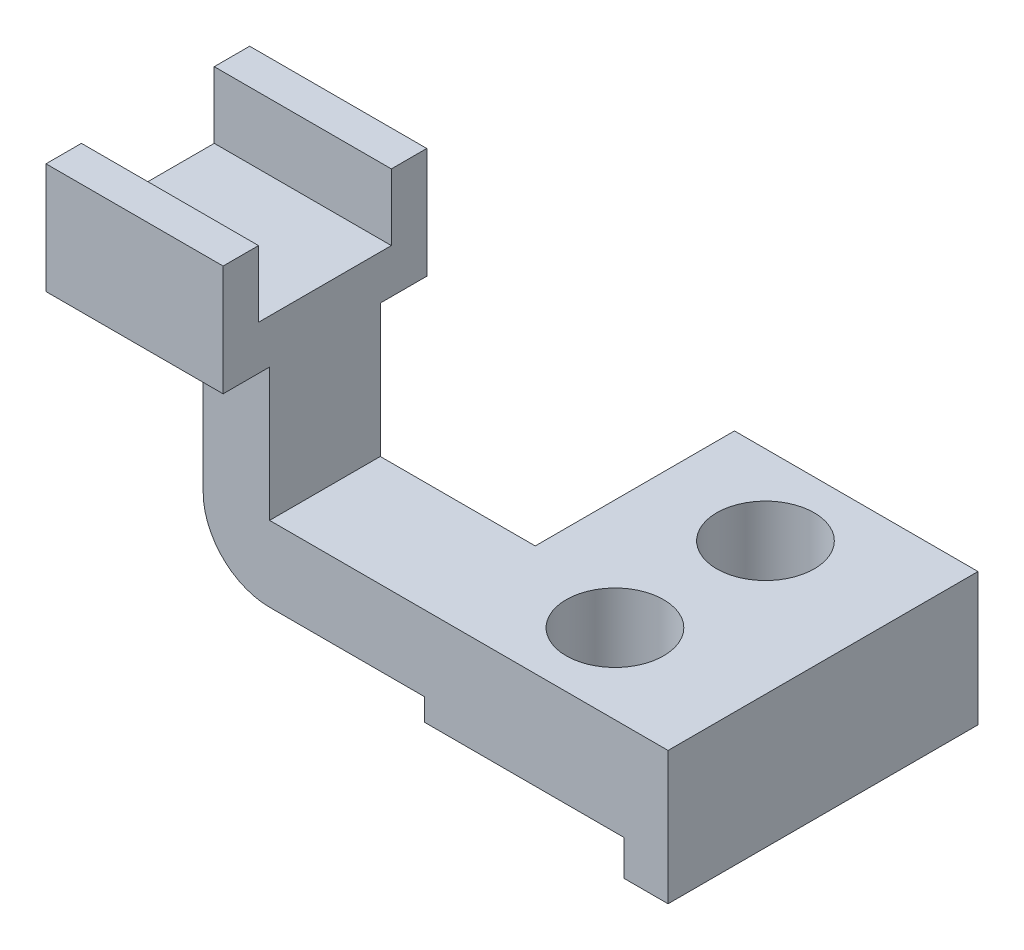
ISO-10303-21;
HEADER;
FILE_DESCRIPTION(('STEP AP214'),'2;1');
FILE_NAME('part.step','',(''),(''),'','','');
FILE_SCHEMA(('AUTOMOTIVE_DESIGN { 1 0 10303 214 1 1 1 1 }'));
ENDSEC;
DATA;
#1=APPLICATION_CONTEXT('core data for automotive mechanical design processes');
#2=APPLICATION_PROTOCOL_DEFINITION('international standard','automotive_design',2000,#1);
#3=PRODUCT_CONTEXT('',#1,'mechanical');
#4=PRODUCT('Part','Part','',(#3));
#5=PRODUCT_RELATED_PRODUCT_CATEGORY('part','',(#4));
#6=PRODUCT_DEFINITION_FORMATION('','',#4);
#7=PRODUCT_DEFINITION_CONTEXT('part definition',#1,'design');
#8=PRODUCT_DEFINITION('design','',#6,#7);
#9=PRODUCT_DEFINITION_SHAPE('','',#8);
#10=(LENGTH_UNIT() NAMED_UNIT(*) SI_UNIT(.MILLI.,.METRE.));
#11=(NAMED_UNIT(*) PLANE_ANGLE_UNIT() SI_UNIT($,.RADIAN.));
#12=(NAMED_UNIT(*) SI_UNIT($,.STERADIAN.) SOLID_ANGLE_UNIT());
#13=UNCERTAINTY_MEASURE_WITH_UNIT(LENGTH_MEASURE(1.E-05),#10,'distance_accuracy_value','');
#14=(GEOMETRIC_REPRESENTATION_CONTEXT(3) GLOBAL_UNCERTAINTY_ASSIGNED_CONTEXT((#13)) GLOBAL_UNIT_ASSIGNED_CONTEXT((#10,
#11,#12)) REPRESENTATION_CONTEXT('',''));
#15=CARTESIAN_POINT('',(0.,0.,0.));
#16=DIRECTION('',(0.,0.,1.));
#17=DIRECTION('',(1.,0.,0.));
#18=AXIS2_PLACEMENT_3D('',#15,#16,#17);
#19=CARTESIAN_POINT('',(0.,30.,0.));
#20=DIRECTION('',(0.,-1.,0.));
#21=DIRECTION('',(0.,0.,-1.));
#22=AXIS2_PLACEMENT_3D('',#19,#20,#21);
#23=PLANE('',#22);
#24=DIRECTION('',(-1.,0.,0.));
#25=VECTOR('',#24,1.);
#26=CARTESIAN_POINT('',(-63.9822183831885,30.,-1.29574439418017));
#27=LINE('',#26,#25);
#28=CARTESIAN_POINT('',(-28.9822183831885,30.,-1.29574439418017));
#29=VERTEX_POINT('',#28);
#30=CARTESIAN_POINT('',(-63.9822183831885,30.,-1.29574439418017));
#31=VERTEX_POINT('',#30);
#32=EDGE_CURVE('E260',#29,#31,#27,.T.);
#33=ORIENTED_EDGE('',*,*,#32,.T.);
#34=DIRECTION('',(0.,0.,1.));
#35=VECTOR('',#34,1.);
#36=CARTESIAN_POINT('',(-63.9822183831885,30.,-1.29574439418017));
#37=LINE('',#36,#35);
#38=CARTESIAN_POINT('',(-63.9822183831885,30.,23.7042556058198));
#39=VERTEX_POINT('',#38);
#40=EDGE_CURVE('E263',#31,#39,#37,.T.);
#41=ORIENTED_EDGE('',*,*,#40,.T.);
#42=DIRECTION('',(1.,0.,0.));
#43=VECTOR('',#42,1.);
#44=CARTESIAN_POINT('',(-63.9822183831885,30.,23.7042556058198));
#45=LINE('',#44,#43);
#46=CARTESIAN_POINT('',(26.0177816168115,30.,23.7042556058198));
#47=VERTEX_POINT('',#46);
#48=EDGE_CURVE('E267',#39,#47,#45,.T.);
#49=ORIENTED_EDGE('',*,*,#48,.T.);
#50=DIRECTION('',(0.,0.,-1.));
#51=VECTOR('',#50,1.);
#52=CARTESIAN_POINT('',(26.0177816168115,30.,-46.2957443941802));
#53=LINE('',#52,#51);
#54=CARTESIAN_POINT('',(26.0177816168115,30.,-46.2957443941802));
#55=VERTEX_POINT('',#54);
#56=EDGE_CURVE('E269',#47,#55,#53,.T.);
#57=ORIENTED_EDGE('',*,*,#56,.T.);
#58=DIRECTION('',(-1.,0.,0.));
#59=VECTOR('',#58,1.);
#60=CARTESIAN_POINT('',(26.0177816168115,30.,-46.2957443941802));
#61=LINE('',#60,#59);
#62=CARTESIAN_POINT('',(-28.9822183831885,30.,-46.2957443941802));
#63=VERTEX_POINT('',#62);
#64=EDGE_CURVE('E271',#55,#63,#61,.T.);
#65=ORIENTED_EDGE('',*,*,#64,.T.);
#66=DIRECTION('',(0.,0.,1.));
#67=VECTOR('',#66,1.);
#68=CARTESIAN_POINT('',(-28.9822183831885,30.,-46.2957443941802));
#69=LINE('',#68,#67);
#70=EDGE_CURVE('E273',#63,#29,#69,.T.);
#71=ORIENTED_EDGE('',*,*,#70,.T.);
#72=EDGE_LOOP('',(#33,#41,#49,#57,#65,#71));
#73=FACE_BOUND('',#72,.T.);
#74=CARTESIAN_POINT('',(-3.98221838318849,30.,5.70425560581984));
#75=DIRECTION('',(0.,1.,0.));
#76=DIRECTION('',(0.,0.,1.));
#77=AXIS2_PLACEMENT_3D('',#74,#75,#76);
#78=CIRCLE('',#77,11.);
#79=CARTESIAN_POINT('',(-3.98221838318849,30.,16.7042556058198));
#80=VERTEX_POINT('',#79);
#81=EDGE_CURVE('E256',#80,#80,#78,.T.);
#82=ORIENTED_EDGE('',*,*,#81,.F.);
#83=EDGE_LOOP('',(#82));
#84=FACE_BOUND('',#83,.T.);
#85=CARTESIAN_POINT('',(-3.98221838318849,30.,-28.2957443941802));
#86=DIRECTION('',(0.,1.,0.));
#87=DIRECTION('',(0.,0.,1.));
#88=AXIS2_PLACEMENT_3D('',#85,#86,#87);
#89=CIRCLE('',#88,11.);
#90=CARTESIAN_POINT('',(-3.98221838318849,30.,-17.2957443941802));
#91=VERTEX_POINT('',#90);
#92=EDGE_CURVE('E253',#91,#91,#89,.T.);
#93=ORIENTED_EDGE('',*,*,#92,.F.);
#94=EDGE_LOOP('',(#93));
#95=FACE_BOUND('',#94,.T.);
#96=ADVANCED_FACE('F38',(#73,#84,#95),#23,.F.);
#97=CARTESIAN_POINT('',(0.,0.,0.));
#98=DIRECTION('',(0.,-1.,0.));
#99=DIRECTION('',(0.,0.,-1.));
#100=AXIS2_PLACEMENT_3D('',#97,#98,#99);
#101=PLANE('',#100);
#102=DIRECTION('',(0.,0.,1.));
#103=VECTOR('',#102,1.);
#104=CARTESIAN_POINT('',(16.0177816168115,0.,-46.2957443941802));
#105=LINE('',#104,#103);
#106=CARTESIAN_POINT('',(16.0177816168115,0.,-46.2957443941802));
#107=VERTEX_POINT('',#106);
#108=CARTESIAN_POINT('',(16.0177816168115,0.,23.7042556058198));
#109=VERTEX_POINT('',#108);
#110=EDGE_CURVE('E246',#107,#109,#105,.T.);
#111=ORIENTED_EDGE('',*,*,#110,.F.);
#112=DIRECTION('',(-1.,0.,0.));
#113=VECTOR('',#112,1.);
#114=CARTESIAN_POINT('',(26.0177816168115,0.,-46.2957443941802));
#115=LINE('',#114,#113);
#116=CARTESIAN_POINT('',(26.0177816168115,0.,-46.2957443941802));
#117=VERTEX_POINT('',#116);
#118=EDGE_CURVE('E264',#117,#107,#115,.T.);
#119=ORIENTED_EDGE('',*,*,#118,.F.);
#120=DIRECTION('',(0.,0.,-1.));
#121=VECTOR('',#120,1.);
#122=CARTESIAN_POINT('',(26.0177816168115,0.,-46.2957443941802));
#123=LINE('',#122,#121);
#124=CARTESIAN_POINT('',(26.0177816168115,0.,23.7042556058198));
#125=VERTEX_POINT('',#124);
#126=EDGE_CURVE('E277',#125,#117,#123,.T.);
#127=ORIENTED_EDGE('',*,*,#126,.F.);
#128=DIRECTION('',(1.,0.,0.));
#129=VECTOR('',#128,1.);
#130=CARTESIAN_POINT('',(-63.9822183831885,0.,23.7042556058198));
#131=LINE('',#130,#129);
#132=EDGE_CURVE('E259',#109,#125,#131,.T.);
#133=ORIENTED_EDGE('',*,*,#132,.F.);
#134=EDGE_LOOP('',(#111,#119,#127,#133));
#135=FACE_BOUND('',#134,.T.);
#136=ADVANCED_FACE('F441',(#135),#101,.T.);
#137=CARTESIAN_POINT('',(-63.9822183831885,30.,-1.29574439418017));
#138=DIRECTION('',(0.,0.,1.));
#139=DIRECTION('',(1.,0.,0.));
#140=AXIS2_PLACEMENT_3D('',#137,#138,#139);
#141=PLANE('',#140);
#142=DIRECTION('',(-1.,0.,0.));
#143=VECTOR('',#142,1.);
#144=CARTESIAN_POINT('',(-63.9822183831885,13.,-1.29574439418017));
#145=LINE('',#144,#143);
#146=CARTESIAN_POINT('',(-28.9822183831885,13.,-1.29574439418017));
#147=VERTEX_POINT('',#146);
#148=CARTESIAN_POINT('',(-63.9822183831885,13.,-1.29574439418017));
#149=VERTEX_POINT('',#148);
#150=EDGE_CURVE('E252',#147,#149,#145,.T.);
#151=ORIENTED_EDGE('',*,*,#150,.T.);
#152=CARTESIAN_POINT('',(-63.9822183831885,28.,-1.29574439418017));
#153=DIRECTION('',(0.,0.,1.));
#154=DIRECTION('',(1.,0.,0.));
#155=AXIS2_PLACEMENT_3D('',#152,#153,#154);
#156=CIRCLE('',#155,15.);
#157=CARTESIAN_POINT('',(-78.9822183831885,28.,-1.29574439418017));
#158=VERTEX_POINT('',#157);
#159=EDGE_CURVE('E12',#149,#158,#156,.F.);
#160=ORIENTED_EDGE('',*,*,#159,.T.);
#161=DIRECTION('',(0.,1.,0.));
#162=VECTOR('',#161,1.);
#163=CARTESIAN_POINT('',(-78.9822183831885,30.,-1.29574439418017));
#164=LINE('',#163,#162);
#165=CARTESIAN_POINT('',(-78.9822183831885,60.,-1.29574439418017));
#166=VERTEX_POINT('',#165);
#167=EDGE_CURVE('E174',#158,#166,#164,.T.);
#168=ORIENTED_EDGE('',*,*,#167,.T.);
#169=DIRECTION('',(-1.,0.,0.));
#170=VECTOR('',#169,1.);
#171=CARTESIAN_POINT('',(-63.9822183831885,60.,-1.29574439418017));
#172=LINE('',#171,#170);
#173=CARTESIAN_POINT('',(-63.9822183831885,60.,-1.29574439418017));
#174=VERTEX_POINT('',#173);
#175=EDGE_CURVE('E179',#174,#166,#172,.T.);
#176=ORIENTED_EDGE('',*,*,#175,.F.);
#177=DIRECTION('',(0.,-1.,0.));
#178=VECTOR('',#177,1.);
#179=CARTESIAN_POINT('',(-63.9822183831885,60.,-1.29574439418017));
#180=LINE('',#179,#178);
#181=EDGE_CURVE('E209',#174,#31,#180,.T.);
#182=ORIENTED_EDGE('',*,*,#181,.T.);
#183=ORIENTED_EDGE('',*,*,#32,.F.);
#184=DIRECTION('',(0.,-1.,0.));
#185=VECTOR('',#184,1.);
#186=CARTESIAN_POINT('',(-28.9822183831885,30.,-1.29574439418017));
#187=LINE('',#186,#185);
#188=EDGE_CURVE('E275',#29,#147,#187,.T.);
#189=ORIENTED_EDGE('',*,*,#188,.T.);
#190=EDGE_LOOP('',(#151,#160,#168,#176,#182,#183,#189));
#191=FACE_BOUND('',#190,.T.);
#192=ADVANCED_FACE('F176',(#191),#141,.F.);
#193=CARTESIAN_POINT('',(-63.9822183831885,30.,23.7042556058198));
#194=DIRECTION('',(0.,0.,-1.));
#195=DIRECTION('',(-1.,0.,0.));
#196=AXIS2_PLACEMENT_3D('',#193,#194,#195);
#197=PLANE('',#196);
#198=DIRECTION('',(0.,1.,0.));
#199=VECTOR('',#198,1.);
#200=CARTESIAN_POINT('',(-78.9822183831885,13.,23.7042556058198));
#201=LINE('',#200,#199);
#202=CARTESIAN_POINT('',(-78.9822183831885,28.,23.7042556058198));
#203=VERTEX_POINT('',#202);
#204=CARTESIAN_POINT('',(-78.9822183831885,60.,23.7042556058198));
#205=VERTEX_POINT('',#204);
#206=EDGE_CURVE('E190',#203,#205,#201,.T.);
#207=ORIENTED_EDGE('',*,*,#206,.F.);
#208=CARTESIAN_POINT('',(-63.9822183831885,28.,23.7042556058198));
#209=DIRECTION('',(0.,0.,-1.));
#210=DIRECTION('',(-1.,0.,0.));
#211=AXIS2_PLACEMENT_3D('',#208,#209,#210);
#212=CIRCLE('',#211,15.);
#213=CARTESIAN_POINT('',(-63.9822183831885,13.,23.7042556058198));
#214=VERTEX_POINT('',#213);
#215=EDGE_CURVE('E60',#203,#214,#212,.F.);
#216=ORIENTED_EDGE('',*,*,#215,.T.);
#217=DIRECTION('',(-1.,0.,0.));
#218=VECTOR('',#217,1.);
#219=CARTESIAN_POINT('',(0.,13.,23.7042556058198));
#220=LINE('',#219,#218);
#221=CARTESIAN_POINT('',(-28.9822183831885,13.,23.7042556058198));
#222=VERTEX_POINT('',#221);
#223=EDGE_CURVE('E235',#222,#214,#220,.T.);
#224=ORIENTED_EDGE('',*,*,#223,.F.);
#225=DIRECTION('',(0.,1.,0.));
#226=VECTOR('',#225,1.);
#227=CARTESIAN_POINT('',(-28.9822183831885,0.,23.7042556058198));
#228=LINE('',#227,#226);
#229=CARTESIAN_POINT('',(-28.9822183831885,7.99999999999999,23.7042556058198));
#230=VERTEX_POINT('',#229);
#231=EDGE_CURVE('E211',#230,#222,#228,.T.);
#232=ORIENTED_EDGE('',*,*,#231,.F.);
#233=DIRECTION('',(-1.,0.,0.));
#234=VECTOR('',#233,1.);
#235=CARTESIAN_POINT('',(0.,8.,23.7042556058198));
#236=LINE('',#235,#234);
#237=CARTESIAN_POINT('',(16.0177816168115,8.,23.7042556058198));
#238=VERTEX_POINT('',#237);
#239=EDGE_CURVE('E229',#238,#230,#236,.T.);
#240=ORIENTED_EDGE('',*,*,#239,.F.);
#241=DIRECTION('',(0.,1.,0.));
#242=VECTOR('',#241,1.);
#243=CARTESIAN_POINT('',(16.0177816168115,0.,23.7042556058198));
#244=LINE('',#243,#242);
#245=EDGE_CURVE('E236',#109,#238,#244,.T.);
#246=ORIENTED_EDGE('',*,*,#245,.F.);
#247=ORIENTED_EDGE('',*,*,#132,.T.);
#248=DIRECTION('',(0.,-1.,0.));
#249=VECTOR('',#248,1.);
#250=CARTESIAN_POINT('',(26.0177816168115,30.,23.7042556058198));
#251=LINE('',#250,#249);
#252=EDGE_CURVE('E288',#47,#125,#251,.T.);
#253=ORIENTED_EDGE('',*,*,#252,.F.);
#254=ORIENTED_EDGE('',*,*,#48,.F.);
#255=DIRECTION('',(0.,1.,0.));
#256=VECTOR('',#255,1.);
#257=CARTESIAN_POINT('',(-63.9822183831885,13.,23.7042556058198));
#258=LINE('',#257,#256);
#259=CARTESIAN_POINT('',(-63.9822183831885,60.,23.7042556058198));
#260=VERTEX_POINT('',#259);
#261=EDGE_CURVE('E212',#39,#260,#258,.T.);
#262=ORIENTED_EDGE('',*,*,#261,.T.);
#263=DIRECTION('',(-1.,0.,0.));
#264=VECTOR('',#263,1.);
#265=CARTESIAN_POINT('',(-63.9822183831885,60.,23.7042556058198));
#266=LINE('',#265,#264);
#267=EDGE_CURVE('E217',#260,#205,#266,.T.);
#268=ORIENTED_EDGE('',*,*,#267,.T.);
#269=EDGE_LOOP('',(#207,#216,#224,#232,#240,#246,#247,#253,#254,#262,#268));
#270=FACE_BOUND('',#269,.T.);
#271=ADVANCED_FACE('F302',(#270),#197,.F.);
#272=CARTESIAN_POINT('',(26.0177816168115,30.,-46.2957443941802));
#273=DIRECTION('',(-1.,0.,0.));
#274=DIRECTION('',(0.,0.,1.));
#275=AXIS2_PLACEMENT_3D('',#272,#273,#274);
#276=PLANE('',#275);
#277=ORIENTED_EDGE('',*,*,#126,.T.);
#278=DIRECTION('',(0.,-1.,0.));
#279=VECTOR('',#278,1.);
#280=CARTESIAN_POINT('',(26.0177816168115,30.,-46.2957443941802));
#281=LINE('',#280,#279);
#282=EDGE_CURVE('E285',#55,#117,#281,.T.);
#283=ORIENTED_EDGE('',*,*,#282,.F.);
#284=ORIENTED_EDGE('',*,*,#56,.F.);
#285=ORIENTED_EDGE('',*,*,#252,.T.);
#286=EDGE_LOOP('',(#277,#283,#284,#285));
#287=FACE_BOUND('',#286,.T.);
#288=ADVANCED_FACE('F457',(#287),#276,.F.);
#289=CARTESIAN_POINT('',(26.0177816168115,30.,-46.2957443941802));
#290=DIRECTION('',(0.,0.,1.));
#291=DIRECTION('',(1.,0.,0.));
#292=AXIS2_PLACEMENT_3D('',#289,#290,#291);
#293=PLANE('',#292);
#294=DIRECTION('',(0.,1.,0.));
#295=VECTOR('',#294,1.);
#296=CARTESIAN_POINT('',(16.0177816168115,0.,-46.2957443941802));
#297=LINE('',#296,#295);
#298=CARTESIAN_POINT('',(16.0177816168115,8.,-46.2957443941802));
#299=VERTEX_POINT('',#298);
#300=EDGE_CURVE('E225',#107,#299,#297,.T.);
#301=ORIENTED_EDGE('',*,*,#300,.T.);
#302=DIRECTION('',(-1.,0.,0.));
#303=VECTOR('',#302,1.);
#304=CARTESIAN_POINT('',(0.,8.,-46.2957443941802));
#305=LINE('',#304,#303);
#306=CARTESIAN_POINT('',(-28.9822183831885,7.99999999999999,-46.2957443941802));
#307=VERTEX_POINT('',#306);
#308=EDGE_CURVE('E228',#299,#307,#305,.T.);
#309=ORIENTED_EDGE('',*,*,#308,.T.);
#310=DIRECTION('',(0.,-1.,0.));
#311=VECTOR('',#310,1.);
#312=CARTESIAN_POINT('',(-28.9822183831885,30.,-46.2957443941802));
#313=LINE('',#312,#311);
#314=EDGE_CURVE('E283',#63,#307,#313,.T.);
#315=ORIENTED_EDGE('',*,*,#314,.F.);
#316=ORIENTED_EDGE('',*,*,#64,.F.);
#317=ORIENTED_EDGE('',*,*,#282,.T.);
#318=ORIENTED_EDGE('',*,*,#118,.T.);
#319=EDGE_LOOP('',(#301,#309,#315,#316,#317,#318));
#320=FACE_BOUND('',#319,.T.);
#321=ADVANCED_FACE('F454',(#320),#293,.F.);
#322=CARTESIAN_POINT('',(-28.9822183831885,30.,-46.2957443941802));
#323=DIRECTION('',(1.,0.,0.));
#324=DIRECTION('',(0.,0.,-1.));
#325=AXIS2_PLACEMENT_3D('',#322,#323,#324);
#326=PLANE('',#325);
#327=ORIENTED_EDGE('',*,*,#314,.T.);
#328=DIRECTION('',(0.,0.,1.));
#329=VECTOR('',#328,1.);
#330=CARTESIAN_POINT('',(-28.9822183831885,7.99999999999999,-46.2957443941802));
#331=LINE('',#330,#329);
#332=EDGE_CURVE('E241',#307,#230,#331,.T.);
#333=ORIENTED_EDGE('',*,*,#332,.T.);
#334=ORIENTED_EDGE('',*,*,#231,.T.);
#335=DIRECTION('',(0.,0.,1.));
#336=VECTOR('',#335,1.);
#337=CARTESIAN_POINT('',(-28.9822183831885,13.,-46.2957443941802));
#338=LINE('',#337,#336);
#339=EDGE_CURVE('E232',#147,#222,#338,.T.);
#340=ORIENTED_EDGE('',*,*,#339,.F.);
#341=ORIENTED_EDGE('',*,*,#188,.F.);
#342=ORIENTED_EDGE('',*,*,#70,.F.);
#343=EDGE_LOOP('',(#327,#333,#334,#340,#341,#342));
#344=FACE_BOUND('',#343,.T.);
#345=ADVANCED_FACE('F433',(#344),#326,.F.);
#346=CARTESIAN_POINT('',(-3.98221838318849,30.,5.70425560581984));
#347=DIRECTION('',(0.,-1.,0.));
#348=DIRECTION('',(0.,0.,-1.));
#349=AXIS2_PLACEMENT_3D('',#346,#347,#348);
#350=CYLINDRICAL_SURFACE('',#349,11.);
#351=CARTESIAN_POINT('',(-3.98221838318849,8.,5.70425560581984));
#352=DIRECTION('',(0.,1.,0.));
#353=DIRECTION('',(-1.,0.,0.));
#354=AXIS2_PLACEMENT_3D('',#351,#352,#353);
#355=CIRCLE('',#354,11.);
#356=CARTESIAN_POINT('',(-14.9822183831885,8.,5.70425560581984));
#357=VERTEX_POINT('',#356);
#358=EDGE_CURVE('E249',#357,#357,#355,.T.);
#359=ORIENTED_EDGE('',*,*,#358,.F.);
#360=EDGE_LOOP('',(#359));
#361=FACE_BOUND('',#360,.T.);
#362=ORIENTED_EDGE('',*,*,#81,.T.);
#363=EDGE_LOOP('',(#362));
#364=FACE_BOUND('',#363,.T.);
#365=ADVANCED_FACE('F449',(#361,#364),#350,.F.);
#366=CARTESIAN_POINT('',(-3.98221838318849,30.,-28.2957443941802));
#367=DIRECTION('',(0.,-1.,0.));
#368=DIRECTION('',(0.,0.,-1.));
#369=AXIS2_PLACEMENT_3D('',#366,#367,#368);
#370=CYLINDRICAL_SURFACE('',#369,11.);
#371=CARTESIAN_POINT('',(-3.98221838318849,8.,-28.2957443941802));
#372=DIRECTION('',(0.,1.,0.));
#373=DIRECTION('',(-1.,0.,0.));
#374=AXIS2_PLACEMENT_3D('',#371,#372,#373);
#375=CIRCLE('',#374,11.);
#376=CARTESIAN_POINT('',(-14.9822183831885,8.,-28.2957443941802));
#377=VERTEX_POINT('',#376);
#378=EDGE_CURVE('E243',#377,#377,#375,.T.);
#379=ORIENTED_EDGE('',*,*,#378,.F.);
#380=EDGE_LOOP('',(#379));
#381=FACE_BOUND('',#380,.T.);
#382=ORIENTED_EDGE('',*,*,#92,.T.);
#383=EDGE_LOOP('',(#382));
#384=FACE_BOUND('',#383,.T.);
#385=ADVANCED_FACE('F492',(#381,#384),#370,.F.);
#386=CARTESIAN_POINT('',(0.,13.,-46.2957443941802));
#387=DIRECTION('',(0.,1.,0.));
#388=DIRECTION('',(0.,0.,1.));
#389=AXIS2_PLACEMENT_3D('',#386,#387,#388);
#390=PLANE('',#389);
#391=ORIENTED_EDGE('',*,*,#223,.T.);
#392=DIRECTION('',(0.,0.,1.));
#393=VECTOR('',#392,1.);
#394=CARTESIAN_POINT('',(-63.9822183831885,13.,-46.2957443941802));
#395=LINE('',#394,#393);
#396=EDGE_CURVE('E46',#214,#149,#395,.F.);
#397=ORIENTED_EDGE('',*,*,#396,.T.);
#398=ORIENTED_EDGE('',*,*,#150,.F.);
#399=ORIENTED_EDGE('',*,*,#339,.T.);
#400=EDGE_LOOP('',(#391,#397,#398,#399));
#401=FACE_BOUND('',#400,.T.);
#402=ADVANCED_FACE('F499',(#401),#390,.F.);
#403=CARTESIAN_POINT('',(0.,8.,-46.2957443941802));
#404=DIRECTION('',(0.,1.,0.));
#405=DIRECTION('',(-1.,0.,0.));
#406=AXIS2_PLACEMENT_3D('',#403,#404,#405);
#407=PLANE('',#406);
#408=ORIENTED_EDGE('',*,*,#358,.T.);
#409=EDGE_LOOP('',(#408));
#410=FACE_BOUND('',#409,.T.);
#411=ORIENTED_EDGE('',*,*,#378,.T.);
#412=EDGE_LOOP('',(#411));
#413=FACE_BOUND('',#412,.T.);
#414=ORIENTED_EDGE('',*,*,#239,.T.);
#415=ORIENTED_EDGE('',*,*,#332,.F.);
#416=ORIENTED_EDGE('',*,*,#308,.F.);
#417=DIRECTION('',(0.,0.,1.));
#418=VECTOR('',#417,1.);
#419=CARTESIAN_POINT('',(16.0177816168115,8.,-46.2957443941802));
#420=LINE('',#419,#418);
#421=EDGE_CURVE('E244',#299,#238,#420,.T.);
#422=ORIENTED_EDGE('',*,*,#421,.T.);
#423=EDGE_LOOP('',(#414,#415,#416,#422));
#424=FACE_BOUND('',#423,.T.);
#425=ADVANCED_FACE('F506',(#410,#413,#424),#407,.F.);
#426=CARTESIAN_POINT('',(16.0177816168115,0.,-46.2957443941802));
#427=DIRECTION('',(1.,0.,0.));
#428=DIRECTION('',(0.,0.,-1.));
#429=AXIS2_PLACEMENT_3D('',#426,#427,#428);
#430=PLANE('',#429);
#431=ORIENTED_EDGE('',*,*,#245,.T.);
#432=ORIENTED_EDGE('',*,*,#421,.F.);
#433=ORIENTED_EDGE('',*,*,#300,.F.);
#434=ORIENTED_EDGE('',*,*,#110,.T.);
#435=EDGE_LOOP('',(#431,#432,#433,#434));
#436=FACE_BOUND('',#435,.T.);
#437=ADVANCED_FACE('F513',(#436),#430,.F.);
#438=CARTESIAN_POINT('',(-63.982218383189,0.,0.));
#439=DIRECTION('',(1.,0.,0.));
#440=DIRECTION('',(0.,0.,-1.));
#441=AXIS2_PLACEMENT_3D('',#438,#439,#440);
#442=PLANE('',#441);
#443=ORIENTED_EDGE('',*,*,#40,.F.);
#444=ORIENTED_EDGE('',*,*,#181,.F.);
#445=DIRECTION('',(0.,0.,1.));
#446=VECTOR('',#445,1.);
#447=CARTESIAN_POINT('',(-63.9822183831885,60.,-11.7957443941802));
#448=LINE('',#447,#446);
#449=CARTESIAN_POINT('',(-63.9822183831885,60.,-11.7957443941802));
#450=VERTEX_POINT('',#449);
#451=EDGE_CURVE('E197',#450,#174,#448,.T.);
#452=ORIENTED_EDGE('',*,*,#451,.F.);
#453=DIRECTION('',(0.,-1.,0.));
#454=VECTOR('',#453,1.);
#455=CARTESIAN_POINT('',(-63.9822183831885,85.,-11.7957443941802));
#456=LINE('',#455,#454);
#457=CARTESIAN_POINT('',(-63.9822183831885,85.,-11.7957443941802));
#458=VERTEX_POINT('',#457);
#459=EDGE_CURVE('E398',#458,#450,#456,.T.);
#460=ORIENTED_EDGE('',*,*,#459,.F.);
#461=DIRECTION('',(0.,0.,-1.));
#462=VECTOR('',#461,1.);
#463=CARTESIAN_POINT('',(-63.9822183831885,85.,-3.79574439418016));
#464=LINE('',#463,#462);
#465=CARTESIAN_POINT('',(-63.9822183831885,85.,-3.79574439418016));
#466=VERTEX_POINT('',#465);
#467=EDGE_CURVE('E384',#466,#458,#464,.T.);
#468=ORIENTED_EDGE('',*,*,#467,.F.);
#469=DIRECTION('',(0.,1.,0.));
#470=VECTOR('',#469,1.);
#471=CARTESIAN_POINT('',(-63.9822183831885,70.,-3.79574439418016));
#472=LINE('',#471,#470);
#473=CARTESIAN_POINT('',(-63.9822183831885,70.,-3.79574439418016));
#474=VERTEX_POINT('',#473);
#475=EDGE_CURVE('E370',#474,#466,#472,.T.);
#476=ORIENTED_EDGE('',*,*,#475,.F.);
#477=DIRECTION('',(0.,0.,-1.));
#478=VECTOR('',#477,1.);
#479=CARTESIAN_POINT('',(-63.9822183831885,70.,26.2042556058198));
#480=LINE('',#479,#478);
#481=CARTESIAN_POINT('',(-63.9822183831885,70.,26.2042556058198));
#482=VERTEX_POINT('',#481);
#483=EDGE_CURVE('E356',#482,#474,#480,.T.);
#484=ORIENTED_EDGE('',*,*,#483,.F.);
#485=DIRECTION('',(0.,-1.,0.));
#486=VECTOR('',#485,1.);
#487=CARTESIAN_POINT('',(-63.9822183831885,85.,26.2042556058198));
#488=LINE('',#487,#486);
#489=CARTESIAN_POINT('',(-63.9822183831885,85.,26.2042556058198));
#490=VERTEX_POINT('',#489);
#491=EDGE_CURVE('E342',#490,#482,#488,.T.);
#492=ORIENTED_EDGE('',*,*,#491,.F.);
#493=DIRECTION('',(0.,0.,-1.));
#494=VECTOR('',#493,1.);
#495=CARTESIAN_POINT('',(-63.9822183831885,85.,34.2042556058198));
#496=LINE('',#495,#494);
#497=CARTESIAN_POINT('',(-63.9822183831885,85.,34.2042556058198));
#498=VERTEX_POINT('',#497);
#499=EDGE_CURVE('E328',#498,#490,#496,.T.);
#500=ORIENTED_EDGE('',*,*,#499,.F.);
#501=DIRECTION('',(0.,1.,0.));
#502=VECTOR('',#501,1.);
#503=CARTESIAN_POINT('',(-63.9822183831885,60.,34.2042556058198));
#504=LINE('',#503,#502);
#505=CARTESIAN_POINT('',(-63.9822183831885,60.,34.2042556058198));
#506=VERTEX_POINT('',#505);
#507=EDGE_CURVE('E309',#506,#498,#504,.T.);
#508=ORIENTED_EDGE('',*,*,#507,.F.);
#509=DIRECTION('',(0.,0.,1.));
#510=VECTOR('',#509,1.);
#511=CARTESIAN_POINT('',(-63.9822183831885,60.,23.7042556058198));
#512=LINE('',#511,#510);
#513=EDGE_CURVE('E222',#260,#506,#512,.T.);
#514=ORIENTED_EDGE('',*,*,#513,.F.);
#515=ORIENTED_EDGE('',*,*,#261,.F.);
#516=EDGE_LOOP('',(#443,#444,#452,#460,#468,#476,#484,#492,#500,#508,#514,#515));
#517=FACE_BOUND('',#516,.T.);
#518=ADVANCED_FACE('F422',(#517),#442,.T.);
#519=CARTESIAN_POINT('',(-103.982218383189,0.,0.));
#520=DIRECTION('',(1.,0.,0.));
#521=DIRECTION('',(0.,0.,-1.));
#522=AXIS2_PLACEMENT_3D('',#519,#520,#521);
#523=PLANE('',#522);
#524=DIRECTION('',(0.,-1.,0.));
#525=VECTOR('',#524,1.);
#526=CARTESIAN_POINT('',(-103.982218383188,85.,-11.7957443941802));
#527=LINE('',#526,#525);
#528=CARTESIAN_POINT('',(-103.982218383188,85.,-11.7957443941802));
#529=VERTEX_POINT('',#528);
#530=CARTESIAN_POINT('',(-103.982218383188,60.,-11.7957443941802));
#531=VERTEX_POINT('',#530);
#532=EDGE_CURVE('E198',#529,#531,#527,.T.);
#533=ORIENTED_EDGE('',*,*,#532,.T.);
#534=DIRECTION('',(0.,0.,1.));
#535=VECTOR('',#534,1.);
#536=CARTESIAN_POINT('',(-103.982218383188,60.,23.7042556058198));
#537=LINE('',#536,#535);
#538=CARTESIAN_POINT('',(-103.982218383188,60.,34.2042556058198));
#539=VERTEX_POINT('',#538);
#540=EDGE_CURVE('E307',#531,#539,#537,.T.);
#541=ORIENTED_EDGE('',*,*,#540,.T.);
#542=DIRECTION('',(0.,1.,0.));
#543=VECTOR('',#542,1.);
#544=CARTESIAN_POINT('',(-103.982218383188,60.,34.2042556058198));
#545=LINE('',#544,#543);
#546=CARTESIAN_POINT('',(-103.982218383188,85.,34.2042556058198));
#547=VERTEX_POINT('',#546);
#548=EDGE_CURVE('E322',#539,#547,#545,.T.);
#549=ORIENTED_EDGE('',*,*,#548,.T.);
#550=DIRECTION('',(0.,0.,-1.));
#551=VECTOR('',#550,1.);
#552=CARTESIAN_POINT('',(-103.982218383188,85.,34.2042556058198));
#553=LINE('',#552,#551);
#554=CARTESIAN_POINT('',(-103.982218383188,85.,26.2042556058198));
#555=VERTEX_POINT('',#554);
#556=EDGE_CURVE('E334',#547,#555,#553,.T.);
#557=ORIENTED_EDGE('',*,*,#556,.T.);
#558=DIRECTION('',(0.,-1.,0.));
#559=VECTOR('',#558,1.);
#560=CARTESIAN_POINT('',(-103.982218383188,85.,26.2042556058198));
#561=LINE('',#560,#559);
#562=CARTESIAN_POINT('',(-103.982218383188,70.,26.2042556058198));
#563=VERTEX_POINT('',#562);
#564=EDGE_CURVE('E348',#555,#563,#561,.T.);
#565=ORIENTED_EDGE('',*,*,#564,.T.);
#566=DIRECTION('',(0.,0.,-1.));
#567=VECTOR('',#566,1.);
#568=CARTESIAN_POINT('',(-103.982218383188,70.,26.2042556058198));
#569=LINE('',#568,#567);
#570=CARTESIAN_POINT('',(-103.982218383188,70.,-3.79574439418016));
#571=VERTEX_POINT('',#570);
#572=EDGE_CURVE('E362',#563,#571,#569,.T.);
#573=ORIENTED_EDGE('',*,*,#572,.T.);
#574=DIRECTION('',(0.,1.,0.));
#575=VECTOR('',#574,1.);
#576=CARTESIAN_POINT('',(-103.982218383188,70.,-3.79574439418016));
#577=LINE('',#576,#575);
#578=CARTESIAN_POINT('',(-103.982218383188,85.,-3.79574439418016));
#579=VERTEX_POINT('',#578);
#580=EDGE_CURVE('E376',#571,#579,#577,.T.);
#581=ORIENTED_EDGE('',*,*,#580,.T.);
#582=DIRECTION('',(0.,0.,-1.));
#583=VECTOR('',#582,1.);
#584=CARTESIAN_POINT('',(-103.982218383188,85.,-3.79574439418016));
#585=LINE('',#584,#583);
#586=EDGE_CURVE('E390',#579,#529,#585,.T.);
#587=ORIENTED_EDGE('',*,*,#586,.T.);
#588=EDGE_LOOP('',(#533,#541,#549,#557,#565,#573,#581,#587));
#589=FACE_BOUND('',#588,.T.);
#590=ADVANCED_FACE('F415',(#589),#523,.F.);
#591=CARTESIAN_POINT('',(-63.9822183831885,60.,-11.7957443941802));
#592=DIRECTION('',(0.,-1.,0.));
#593=DIRECTION('',(0.,0.,-1.));
#594=AXIS2_PLACEMENT_3D('',#591,#592,#593);
#595=PLANE('',#594);
#596=ORIENTED_EDGE('',*,*,#175,.T.);
#597=DIRECTION('',(0.,0.,1.));
#598=VECTOR('',#597,1.);
#599=CARTESIAN_POINT('',(-78.9822183831885,60.,-22.2957443941802));
#600=LINE('',#599,#598);
#601=EDGE_CURVE('E186',#166,#205,#600,.T.);
#602=ORIENTED_EDGE('',*,*,#601,.T.);
#603=ORIENTED_EDGE('',*,*,#267,.F.);
#604=ORIENTED_EDGE('',*,*,#513,.T.);
#605=DIRECTION('',(-1.,0.,0.));
#606=VECTOR('',#605,1.);
#607=CARTESIAN_POINT('',(-63.9822183831885,60.,34.2042556058198));
#608=LINE('',#607,#606);
#609=EDGE_CURVE('E314',#506,#539,#608,.T.);
#610=ORIENTED_EDGE('',*,*,#609,.T.);
#611=ORIENTED_EDGE('',*,*,#540,.F.);
#612=DIRECTION('',(-1.,0.,0.));
#613=VECTOR('',#612,1.);
#614=CARTESIAN_POINT('',(-63.9822183831885,60.,-11.7957443941802));
#615=LINE('',#614,#613);
#616=EDGE_CURVE('E185',#450,#531,#615,.T.);
#617=ORIENTED_EDGE('',*,*,#616,.F.);
#618=ORIENTED_EDGE('',*,*,#451,.T.);
#619=EDGE_LOOP('',(#596,#602,#603,#604,#610,#611,#617,#618));
#620=FACE_BOUND('',#619,.T.);
#621=ADVANCED_FACE('F195',(#620),#595,.T.);
#622=CARTESIAN_POINT('',(-63.9822183831885,85.,-11.7957443941802));
#623=DIRECTION('',(0.,0.,-1.));
#624=DIRECTION('',(-1.,0.,0.));
#625=AXIS2_PLACEMENT_3D('',#622,#623,#624);
#626=PLANE('',#625);
#627=ORIENTED_EDGE('',*,*,#532,.F.);
#628=DIRECTION('',(-1.,0.,0.));
#629=VECTOR('',#628,1.);
#630=CARTESIAN_POINT('',(-63.9822183831885,85.,-11.7957443941802));
#631=LINE('',#630,#629);
#632=EDGE_CURVE('E201',#458,#529,#631,.T.);
#633=ORIENTED_EDGE('',*,*,#632,.F.);
#634=ORIENTED_EDGE('',*,*,#459,.T.);
#635=ORIENTED_EDGE('',*,*,#616,.T.);
#636=EDGE_LOOP('',(#627,#633,#634,#635));
#637=FACE_BOUND('',#636,.T.);
#638=ADVANCED_FACE('F413',(#637),#626,.T.);
#639=CARTESIAN_POINT('',(-63.9822183831885,85.,-3.79574439418016));
#640=DIRECTION('',(0.,1.,0.));
#641=DIRECTION('',(0.,0.,1.));
#642=AXIS2_PLACEMENT_3D('',#639,#640,#641);
#643=PLANE('',#642);
#644=ORIENTED_EDGE('',*,*,#586,.F.);
#645=DIRECTION('',(-1.,0.,0.));
#646=VECTOR('',#645,1.);
#647=CARTESIAN_POINT('',(-63.9822183831885,85.,-3.79574439418016));
#648=LINE('',#647,#646);
#649=EDGE_CURVE('E387',#466,#579,#648,.T.);
#650=ORIENTED_EDGE('',*,*,#649,.F.);
#651=ORIENTED_EDGE('',*,*,#467,.T.);
#652=ORIENTED_EDGE('',*,*,#632,.T.);
#653=EDGE_LOOP('',(#644,#650,#651,#652));
#654=FACE_BOUND('',#653,.T.);
#655=ADVANCED_FACE('F420',(#654),#643,.T.);
#656=CARTESIAN_POINT('',(-63.9822183831885,70.,-3.79574439418016));
#657=DIRECTION('',(0.,0.,1.));
#658=DIRECTION('',(1.,0.,0.));
#659=AXIS2_PLACEMENT_3D('',#656,#657,#658);
#660=PLANE('',#659);
#661=ORIENTED_EDGE('',*,*,#580,.F.);
#662=DIRECTION('',(-1.,0.,0.));
#663=VECTOR('',#662,1.);
#664=CARTESIAN_POINT('',(-63.9822183831885,70.,-3.79574439418016));
#665=LINE('',#664,#663);
#666=EDGE_CURVE('E373',#474,#571,#665,.T.);
#667=ORIENTED_EDGE('',*,*,#666,.F.);
#668=ORIENTED_EDGE('',*,*,#475,.T.);
#669=ORIENTED_EDGE('',*,*,#649,.T.);
#670=EDGE_LOOP('',(#661,#667,#668,#669));
#671=FACE_BOUND('',#670,.T.);
#672=ADVANCED_FACE('F552',(#671),#660,.T.);
#673=CARTESIAN_POINT('',(-63.9822183831885,70.,26.2042556058198));
#674=DIRECTION('',(0.,1.,0.));
#675=DIRECTION('',(0.,0.,1.));
#676=AXIS2_PLACEMENT_3D('',#673,#674,#675);
#677=PLANE('',#676);
#678=ORIENTED_EDGE('',*,*,#572,.F.);
#679=DIRECTION('',(-1.,0.,0.));
#680=VECTOR('',#679,1.);
#681=CARTESIAN_POINT('',(-63.9822183831885,70.,26.2042556058198));
#682=LINE('',#681,#680);
#683=EDGE_CURVE('E359',#482,#563,#682,.T.);
#684=ORIENTED_EDGE('',*,*,#683,.F.);
#685=ORIENTED_EDGE('',*,*,#483,.T.);
#686=ORIENTED_EDGE('',*,*,#666,.T.);
#687=EDGE_LOOP('',(#678,#684,#685,#686));
#688=FACE_BOUND('',#687,.T.);
#689=ADVANCED_FACE('F559',(#688),#677,.T.);
#690=CARTESIAN_POINT('',(-63.9822183831885,85.,26.2042556058198));
#691=DIRECTION('',(0.,0.,-1.));
#692=DIRECTION('',(-1.,0.,0.));
#693=AXIS2_PLACEMENT_3D('',#690,#691,#692);
#694=PLANE('',#693);
#695=ORIENTED_EDGE('',*,*,#564,.F.);
#696=DIRECTION('',(-1.,0.,0.));
#697=VECTOR('',#696,1.);
#698=CARTESIAN_POINT('',(-63.9822183831885,85.,26.2042556058198));
#699=LINE('',#698,#697);
#700=EDGE_CURVE('E345',#490,#555,#699,.T.);
#701=ORIENTED_EDGE('',*,*,#700,.F.);
#702=ORIENTED_EDGE('',*,*,#491,.T.);
#703=ORIENTED_EDGE('',*,*,#683,.T.);
#704=EDGE_LOOP('',(#695,#701,#702,#703));
#705=FACE_BOUND('',#704,.T.);
#706=ADVANCED_FACE('F567',(#705),#694,.T.);
#707=CARTESIAN_POINT('',(-63.9822183831885,85.,34.2042556058198));
#708=DIRECTION('',(0.,1.,0.));
#709=DIRECTION('',(0.,0.,1.));
#710=AXIS2_PLACEMENT_3D('',#707,#708,#709);
#711=PLANE('',#710);
#712=ORIENTED_EDGE('',*,*,#556,.F.);
#713=DIRECTION('',(-1.,0.,0.));
#714=VECTOR('',#713,1.);
#715=CARTESIAN_POINT('',(-63.9822183831885,85.,34.2042556058198));
#716=LINE('',#715,#714);
#717=EDGE_CURVE('E331',#498,#547,#716,.T.);
#718=ORIENTED_EDGE('',*,*,#717,.F.);
#719=ORIENTED_EDGE('',*,*,#499,.T.);
#720=ORIENTED_EDGE('',*,*,#700,.T.);
#721=EDGE_LOOP('',(#712,#718,#719,#720));
#722=FACE_BOUND('',#721,.T.);
#723=ADVANCED_FACE('F575',(#722),#711,.T.);
#724=CARTESIAN_POINT('',(-63.9822183831885,60.,34.2042556058198));
#725=DIRECTION('',(0.,0.,1.));
#726=DIRECTION('',(1.,0.,0.));
#727=AXIS2_PLACEMENT_3D('',#724,#725,#726);
#728=PLANE('',#727);
#729=ORIENTED_EDGE('',*,*,#548,.F.);
#730=ORIENTED_EDGE('',*,*,#609,.F.);
#731=ORIENTED_EDGE('',*,*,#507,.T.);
#732=ORIENTED_EDGE('',*,*,#717,.T.);
#733=EDGE_LOOP('',(#729,#730,#731,#732));
#734=FACE_BOUND('',#733,.T.);
#735=ADVANCED_FACE('F438',(#734),#728,.T.);
#736=CARTESIAN_POINT('',(-78.9822183831885,13.,-22.2957443941802));
#737=DIRECTION('',(1.,0.,0.));
#738=DIRECTION('',(0.,0.,-1.));
#739=AXIS2_PLACEMENT_3D('',#736,#737,#738);
#740=PLANE('',#739);
#741=ORIENTED_EDGE('',*,*,#167,.F.);
#742=DIRECTION('',(0.,0.,1.));
#743=VECTOR('',#742,1.);
#744=CARTESIAN_POINT('',(-78.9822183831885,28.,-22.2957443941802));
#745=LINE('',#744,#743);
#746=EDGE_CURVE('E291',#158,#203,#745,.T.);
#747=ORIENTED_EDGE('',*,*,#746,.T.);
#748=ORIENTED_EDGE('',*,*,#206,.T.);
#749=ORIENTED_EDGE('',*,*,#601,.F.);
#750=EDGE_LOOP('',(#741,#747,#748,#749));
#751=FACE_BOUND('',#750,.T.);
#752=ADVANCED_FACE('F189',(#751),#740,.F.);
#753=CARTESIAN_POINT('',(-63.9822183831885,28.,-22.2957443941802));
#754=DIRECTION('',(0.,0.,1.));
#755=DIRECTION('',(1.,0.,0.));
#756=AXIS2_PLACEMENT_3D('',#753,#754,#755);
#757=CYLINDRICAL_SURFACE('',#756,15.);
#758=ORIENTED_EDGE('',*,*,#159,.F.);
#759=ORIENTED_EDGE('',*,*,#396,.F.);
#760=ORIENTED_EDGE('',*,*,#215,.F.);
#761=ORIENTED_EDGE('',*,*,#746,.F.);
#762=EDGE_LOOP('',(#758,#759,#760,#761));
#763=FACE_BOUND('',#762,.T.);
#764=ADVANCED_FACE('F40',(#763),#757,.T.);
#765=CLOSED_SHELL('',(#96,#136,#192,#271,#288,#321,#345,#365,#385,#402,#425,#437,#518,#590,#621,
#638,#655,#672,#689,#706,#723,#735,#752,#764));
#766=MANIFOLD_SOLID_BREP('B2',#765);
#767=ADVANCED_BREP_SHAPE_REPRESENTATION('',(#18,#766),#14);
#768=SHAPE_DEFINITION_REPRESENTATION(#9,#767);
ENDSEC;
END-ISO-10303-21;
